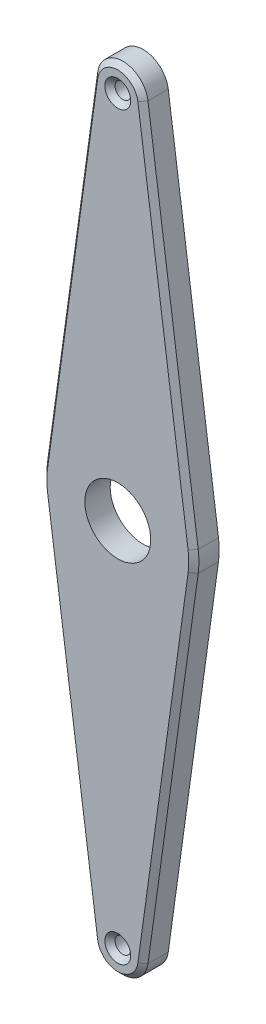
ISO-10303-21;
HEADER;
FILE_DESCRIPTION(('STEP AP214'),'2;1');
FILE_NAME('part.step','',(''),(''),'','','');
FILE_SCHEMA(('AUTOMOTIVE_DESIGN { 1 0 10303 214 1 1 1 1 }'));
ENDSEC;
DATA;
#1=APPLICATION_CONTEXT('core data for automotive mechanical design processes');
#2=APPLICATION_PROTOCOL_DEFINITION('international standard','automotive_design',2000,#1);
#3=PRODUCT_CONTEXT('',#1,'mechanical');
#4=PRODUCT('Part','Part','',(#3));
#5=PRODUCT_RELATED_PRODUCT_CATEGORY('part','',(#4));
#6=PRODUCT_DEFINITION_FORMATION('','',#4);
#7=PRODUCT_DEFINITION_CONTEXT('part definition',#1,'design');
#8=PRODUCT_DEFINITION('design','',#6,#7);
#9=PRODUCT_DEFINITION_SHAPE('','',#8);
#10=(LENGTH_UNIT() NAMED_UNIT(*) SI_UNIT(.MILLI.,.METRE.));
#11=(NAMED_UNIT(*) PLANE_ANGLE_UNIT() SI_UNIT($,.RADIAN.));
#12=(NAMED_UNIT(*) SI_UNIT($,.STERADIAN.) SOLID_ANGLE_UNIT());
#13=UNCERTAINTY_MEASURE_WITH_UNIT(LENGTH_MEASURE(1.E-05),#10,'distance_accuracy_value','');
#14=(GEOMETRIC_REPRESENTATION_CONTEXT(3) GLOBAL_UNCERTAINTY_ASSIGNED_CONTEXT((#13)) GLOBAL_UNIT_ASSIGNED_CONTEXT((#10,
#11,#12)) REPRESENTATION_CONTEXT('',''));
#15=CARTESIAN_POINT('',(0.,0.,0.));
#16=DIRECTION('',(0.,0.,1.));
#17=DIRECTION('',(1.,0.,0.));
#18=AXIS2_PLACEMENT_3D('',#15,#16,#17);
#19=CARTESIAN_POINT('',(0.,0.,5.00000000000002));
#20=DIRECTION('',(0.,0.,1.00000000000001));
#21=DIRECTION('',(1.,0.,0.));
#22=AXIS2_PLACEMENT_3D('',#19,#20,#21);
#23=PLANE('',#22);
#24=CARTESIAN_POINT('',(85.,68.,5.));
#25=DIRECTION('',(0.,0.,1.00000000000001));
#26=DIRECTION('',(1.,0.,0.));
#27=AXIS2_PLACEMENT_3D('',#24,#25,#26);
#28=CIRCLE('',#27,6.5);
#29=CARTESIAN_POINT('',(91.5,68.,5.));
#30=VERTEX_POINT('',#29);
#31=EDGE_CURVE('E343',#30,#30,#28,.F.);
#32=ORIENTED_EDGE('',*,*,#31,.T.);
#33=EDGE_LOOP('',(#32));
#34=FACE_BOUND('',#33,.T.);
#35=CARTESIAN_POINT('',(85.,-4.99999999999984,5.));
#36=DIRECTION('',(0.,0.,1.00000000000001));
#37=DIRECTION('',(1.,0.,0.));
#38=AXIS2_PLACEMENT_3D('',#35,#36,#37);
#39=CIRCLE('',#38,2.55000000000002);
#40=CARTESIAN_POINT('',(87.55,-4.99999999999984,5.));
#41=VERTEX_POINT('',#40);
#42=EDGE_CURVE('E42',#41,#41,#39,.F.);
#43=ORIENTED_EDGE('',*,*,#42,.T.);
#44=EDGE_LOOP('',(#43));
#45=FACE_BOUND('',#44,.T.);
#46=CARTESIAN_POINT('',(85.,68.,5.));
#47=DIRECTION('',(0.,0.,1.00000000000001));
#48=DIRECTION('',(1.,0.,0.));
#49=AXIS2_PLACEMENT_3D('',#46,#47,#48);
#50=CIRCLE('',#49,14.);
#51=CARTESIAN_POINT('',(71.1319788133111,69.9178082191781,5.00000000000002));
#52=VERTEX_POINT('',#51);
#53=CARTESIAN_POINT('',(71.1319788133111,66.0821917808219,5.00000000000002));
#54=VERTEX_POINT('',#53);
#55=EDGE_CURVE('E196',#52,#54,#50,.T.);
#56=ORIENTED_EDGE('',*,*,#55,.T.);
#57=DIRECTION('',(0.136986301369863,-0.990572941906352,0.));
#58=VECTOR('',#57,1.);
#59=CARTESIAN_POINT('',(78.764187639776,10.8922970623549,5.00000000000002));
#60=LINE('',#59,#58);
#61=CARTESIAN_POINT('',(81.0377082323746,-5.54794520547928,5.00000000000002));
#62=VERTEX_POINT('',#61);
#63=EDGE_CURVE('E198',#54,#62,#60,.T.);
#64=ORIENTED_EDGE('',*,*,#63,.T.);
#65=CARTESIAN_POINT('',(85.,-4.99999999999984,5.));
#66=DIRECTION('',(0.,0.,1.00000000000001));
#67=DIRECTION('',(1.,0.,0.));
#68=AXIS2_PLACEMENT_3D('',#65,#66,#67);
#69=CIRCLE('',#68,3.99999999999996);
#70=CARTESIAN_POINT('',(88.9622917676253,-5.54794520547928,5.00000000000002));
#71=VERTEX_POINT('',#70);
#72=EDGE_CURVE('E184',#62,#71,#69,.T.);
#73=ORIENTED_EDGE('',*,*,#72,.T.);
#74=DIRECTION('',(0.136986301369863,0.990572941906352,0.));
#75=VECTOR('',#74,1.);
#76=CARTESIAN_POINT('',(98.8680211866889,66.0821917808221,5.00000000000002));
#77=LINE('',#76,#75);
#78=CARTESIAN_POINT('',(98.8680211866889,66.0821917808221,5.00000000000002));
#79=VERTEX_POINT('',#78);
#80=EDGE_CURVE('E186',#71,#79,#77,.T.);
#81=ORIENTED_EDGE('',*,*,#80,.T.);
#82=CARTESIAN_POINT('',(85.,68.,5.));
#83=DIRECTION('',(0.,0.,1.00000000000001));
#84=DIRECTION('',(1.,0.,0.));
#85=AXIS2_PLACEMENT_3D('',#82,#83,#84);
#86=CIRCLE('',#85,14.);
#87=CARTESIAN_POINT('',(98.8680211866889,69.9178082191782,5.));
#88=VERTEX_POINT('',#87);
#89=EDGE_CURVE('E188',#79,#88,#86,.T.);
#90=ORIENTED_EDGE('',*,*,#89,.T.);
#91=DIRECTION('',(-0.136986301369863,0.990572941906352,0.));
#92=VECTOR('',#91,1.);
#93=CARTESIAN_POINT('',(106.500230013154,14.727913500711,5.00000000000002));
#94=LINE('',#93,#92);
#95=CARTESIAN_POINT('',(88.9622917676254,141.547945205479,5.));
#96=VERTEX_POINT('',#95);
#97=EDGE_CURVE('E190',#88,#96,#94,.T.);
#98=ORIENTED_EDGE('',*,*,#97,.T.);
#99=CARTESIAN_POINT('',(85.,141.,5.));
#100=DIRECTION('',(0.,0.,1.00000000000001));
#101=DIRECTION('',(1.,0.,0.));
#102=AXIS2_PLACEMENT_3D('',#99,#100,#101);
#103=CIRCLE('',#102,3.99999999999996);
#104=CARTESIAN_POINT('',(81.0377082323746,141.547945205479,5.00000000000002));
#105=VERTEX_POINT('',#104);
#106=EDGE_CURVE('E192',#96,#105,#103,.T.);
#107=ORIENTED_EDGE('',*,*,#106,.T.);
#108=DIRECTION('',(-0.136986301369863,-0.990572941906352,0.));
#109=VECTOR('',#108,1.);
#110=CARTESIAN_POINT('',(71.1319788133111,69.9178082191781,5.00000000000002));
#111=LINE('',#110,#109);
#112=EDGE_CURVE('E194',#105,#52,#111,.T.);
#113=ORIENTED_EDGE('',*,*,#112,.T.);
#114=EDGE_LOOP('',(#56,#64,#73,#81,#90,#98,#107,#113));
#115=FACE_BOUND('',#114,.T.);
#116=CARTESIAN_POINT('',(85.,141.,5.));
#117=DIRECTION('',(0.,0.,1.00000000000001));
#118=DIRECTION('',(1.,0.,0.));
#119=AXIS2_PLACEMENT_3D('',#116,#117,#118);
#120=CIRCLE('',#119,2.55000000000004);
#121=CARTESIAN_POINT('',(87.55,141.,5.));
#122=VERTEX_POINT('',#121);
#123=EDGE_CURVE('E234',#122,#122,#120,.F.);
#124=ORIENTED_EDGE('',*,*,#123,.T.);
#125=EDGE_LOOP('',(#124));
#126=FACE_BOUND('',#125,.T.);
#127=ADVANCED_FACE('F34',(#34,#45,#115,#126),#23,.T.);
#128=CARTESIAN_POINT('',(0.,0.,0.));
#129=DIRECTION('',(0.,0.,1.00000000000001));
#130=DIRECTION('',(1.,0.,0.));
#131=AXIS2_PLACEMENT_3D('',#128,#129,#130);
#132=PLANE('',#131);
#133=CARTESIAN_POINT('',(85.,68.,0.));
#134=DIRECTION('',(0.,0.,-1.00000000000001));
#135=DIRECTION('',(-1.,0.,0.));
#136=AXIS2_PLACEMENT_3D('',#133,#134,#135);
#137=CIRCLE('',#136,6.5);
#138=CARTESIAN_POINT('',(78.5,68.,0.));
#139=VERTEX_POINT('',#138);
#140=EDGE_CURVE('E339',#139,#139,#137,.T.);
#141=ORIENTED_EDGE('',*,*,#140,.F.);
#142=EDGE_LOOP('',(#141));
#143=FACE_BOUND('',#142,.T.);
#144=CARTESIAN_POINT('',(85.,-5.,0.));
#145=DIRECTION('',(0.,0.,1.00000000000001));
#146=DIRECTION('',(1.,0.,0.));
#147=AXIS2_PLACEMENT_3D('',#144,#145,#146);
#148=CIRCLE('',#147,4.99999999999999);
#149=CARTESIAN_POINT('',(89.9528647095317,-5.68493150684932,0.));
#150=VERTEX_POINT('',#149);
#151=CARTESIAN_POINT('',(80.0471352904682,-5.68493150684932,0.));
#152=VERTEX_POINT('',#151);
#153=EDGE_CURVE('E138',#150,#152,#148,.F.);
#154=ORIENTED_EDGE('',*,*,#153,.T.);
#155=DIRECTION('',(-0.136986301369863,0.990572941906352,0.));
#156=VECTOR('',#155,1.);
#157=CARTESIAN_POINT('',(77.7736146978696,10.755310760985,0.));
#158=LINE('',#157,#156);
#159=CARTESIAN_POINT('',(70.1414058714047,65.9452054794521,0.));
#160=VERTEX_POINT('',#159);
#161=EDGE_CURVE('E168',#152,#160,#158,.T.);
#162=ORIENTED_EDGE('',*,*,#161,.T.);
#163=CARTESIAN_POINT('',(85.,68.,0.));
#164=DIRECTION('',(0.,0.,1.00000000000001));
#165=DIRECTION('',(1.,0.,0.));
#166=AXIS2_PLACEMENT_3D('',#163,#164,#165);
#167=CIRCLE('',#166,15.);
#168=CARTESIAN_POINT('',(70.1414058714047,70.054794520548,0.));
#169=VERTEX_POINT('',#168);
#170=EDGE_CURVE('E165',#169,#160,#167,.T.);
#171=ORIENTED_EDGE('',*,*,#170,.F.);
#172=DIRECTION('',(-0.136986301369863,-0.990572941906352,0.));
#173=VECTOR('',#172,1.);
#174=CARTESIAN_POINT('',(59.3191050952307,-8.2032372012177,0.));
#175=LINE('',#174,#173);
#176=CARTESIAN_POINT('',(80.0471352904682,141.684931506849,0.));
#177=VERTEX_POINT('',#176);
#178=EDGE_CURVE('E162',#177,#169,#175,.T.);
#179=ORIENTED_EDGE('',*,*,#178,.F.);
#180=CARTESIAN_POINT('',(85.,141.,0.));
#181=DIRECTION('',(0.,0.,1.00000000000001));
#182=DIRECTION('',(1.,0.,0.));
#183=AXIS2_PLACEMENT_3D('',#180,#181,#182);
#184=CIRCLE('',#183,4.99999999999999);
#185=CARTESIAN_POINT('',(89.9528647095317,141.684931506849,0.));
#186=VERTEX_POINT('',#185);
#187=EDGE_CURVE('E159',#186,#177,#184,.T.);
#188=ORIENTED_EDGE('',*,*,#187,.F.);
#189=DIRECTION('',(0.136986301369863,-0.990572941906352,0.));
#190=VECTOR('',#189,1.);
#191=CARTESIAN_POINT('',(107.49080295506,14.8648998020809,0.));
#192=LINE('',#191,#190);
#193=CARTESIAN_POINT('',(99.8585941285953,70.0547945205481,0.));
#194=VERTEX_POINT('',#193);
#195=EDGE_CURVE('E157',#186,#194,#192,.T.);
#196=ORIENTED_EDGE('',*,*,#195,.T.);
#197=CARTESIAN_POINT('',(85.,68.,0.));
#198=DIRECTION('',(0.,0.,1.00000000000001));
#199=DIRECTION('',(1.,0.,0.));
#200=AXIS2_PLACEMENT_3D('',#197,#198,#199);
#201=CIRCLE('',#200,15.);
#202=CARTESIAN_POINT('',(99.8585941285952,65.9452054794522,0.));
#203=VERTEX_POINT('',#202);
#204=EDGE_CURVE('E142',#203,#194,#201,.T.);
#205=ORIENTED_EDGE('',*,*,#204,.F.);
#206=DIRECTION('',(0.136986301369863,0.990572941906352,0.));
#207=VECTOR('',#206,1.);
#208=CARTESIAN_POINT('',(89.0362933524212,-12.3128262423136,0.));
#209=LINE('',#208,#207);
#210=EDGE_CURVE('E125',#150,#203,#209,.T.);
#211=ORIENTED_EDGE('',*,*,#210,.F.);
#212=EDGE_LOOP('',(#154,#162,#171,#179,#188,#196,#205,#211));
#213=FACE_BOUND('',#212,.T.);
#214=CARTESIAN_POINT('',(85.,141.,0.));
#215=DIRECTION('',(0.,0.,1.00000000000001));
#216=DIRECTION('',(1.,0.,0.));
#217=AXIS2_PLACEMENT_3D('',#214,#215,#216);
#218=CIRCLE('',#217,1.55000000000001);
#219=CARTESIAN_POINT('',(86.55,141.,0.));
#220=VERTEX_POINT('',#219);
#221=EDGE_CURVE('E153',#220,#220,#218,.F.);
#222=ORIENTED_EDGE('',*,*,#221,.F.);
#223=EDGE_LOOP('',(#222));
#224=FACE_BOUND('',#223,.T.);
#225=CARTESIAN_POINT('',(85.,-5.,0.));
#226=DIRECTION('',(0.,0.,1.00000000000001));
#227=DIRECTION('',(1.,0.,0.));
#228=AXIS2_PLACEMENT_3D('',#225,#226,#227);
#229=CIRCLE('',#228,1.55000000000001);
#230=CARTESIAN_POINT('',(86.55,-5.,0.));
#231=VERTEX_POINT('',#230);
#232=EDGE_CURVE('E337',#231,#231,#229,.T.);
#233=ORIENTED_EDGE('',*,*,#232,.T.);
#234=EDGE_LOOP('',(#233));
#235=FACE_BOUND('',#234,.T.);
#236=ADVANCED_FACE('F135',(#143,#213,#224,#235),#132,.F.);
#237=CARTESIAN_POINT('',(85.,-4.99999999999984,5.));
#238=DIRECTION('',(0.,0.,-1.00000000000001));
#239=DIRECTION('',(-1.,0.,0.));
#240=AXIS2_PLACEMENT_3D('',#237,#238,#239);
#241=CYLINDRICAL_SURFACE('',#240,4.99999999999999);
#242=DIRECTION('',(0.,0.,-1.00000000000001));
#243=VECTOR('',#242,1.);
#244=CARTESIAN_POINT('',(89.9528647095317,-5.68493150684915,5.00000000000002));
#245=LINE('',#244,#243);
#246=CARTESIAN_POINT('',(89.9528647095317,-5.68493150684915,3.99999999999999));
#247=VERTEX_POINT('',#246);
#248=EDGE_CURVE('E122',#247,#150,#245,.T.);
#249=ORIENTED_EDGE('',*,*,#248,.F.);
#250=CARTESIAN_POINT('',(85.,-4.99999999999984,3.99999999999998));
#251=DIRECTION('',(0.,0.,1.00000000000001));
#252=DIRECTION('',(1.,0.,0.));
#253=AXIS2_PLACEMENT_3D('',#250,#251,#252);
#254=CIRCLE('',#253,4.99999999999999);
#255=CARTESIAN_POINT('',(80.0471352904682,-5.6849315068493,3.99999999999999));
#256=VERTEX_POINT('',#255);
#257=EDGE_CURVE('E211',#247,#256,#254,.F.);
#258=ORIENTED_EDGE('',*,*,#257,.T.);
#259=DIRECTION('',(0.,0.,-1.00000000000001));
#260=VECTOR('',#259,1.);
#261=CARTESIAN_POINT('',(80.0471352904682,-5.68493150684915,5.00000000000002));
#262=LINE('',#261,#260);
#263=EDGE_CURVE('E146',#256,#152,#262,.T.);
#264=ORIENTED_EDGE('',*,*,#263,.T.);
#265=ORIENTED_EDGE('',*,*,#153,.F.);
#266=EDGE_LOOP('',(#249,#258,#264,#265));
#267=FACE_BOUND('',#266,.T.);
#268=ADVANCED_FACE('F144',(#267),#241,.T.);
#269=CARTESIAN_POINT('',(89.0362933524212,-12.3128262423134,5.00000000000002));
#270=DIRECTION('',(-0.990572941906352,0.136986301369863,0.));
#271=DIRECTION('',(-0.136986301369863,-0.990572941906352,0.));
#272=AXIS2_PLACEMENT_3D('',#269,#270,#271);
#273=PLANE('',#272);
#274=DIRECTION('',(0.,0.,-1.00000000000001));
#275=VECTOR('',#274,1.);
#276=CARTESIAN_POINT('',(99.8585941285952,65.9452054794522,5.));
#277=LINE('',#276,#275);
#278=CARTESIAN_POINT('',(99.8585941285952,65.9452054794522,3.99999999999998));
#279=VERTEX_POINT('',#278);
#280=EDGE_CURVE('E131',#279,#203,#277,.T.);
#281=ORIENTED_EDGE('',*,*,#280,.F.);
#282=DIRECTION('',(-0.136986301369863,-0.990572941906352,0.));
#283=VECTOR('',#282,1.);
#284=CARTESIAN_POINT('',(89.9528647095317,-5.68493150684915,3.99999999999999));
#285=LINE('',#284,#283);
#286=EDGE_CURVE('E49',#279,#247,#285,.T.);
#287=ORIENTED_EDGE('',*,*,#286,.T.);
#288=ORIENTED_EDGE('',*,*,#248,.T.);
#289=ORIENTED_EDGE('',*,*,#210,.T.);
#290=EDGE_LOOP('',(#281,#287,#288,#289));
#291=FACE_BOUND('',#290,.T.);
#292=ADVANCED_FACE('F124',(#291),#273,.F.);
#293=CARTESIAN_POINT('',(85.,68.,5.));
#294=DIRECTION('',(0.,0.,-1.00000000000001));
#295=DIRECTION('',(-1.,0.,0.));
#296=AXIS2_PLACEMENT_3D('',#293,#294,#295);
#297=CYLINDRICAL_SURFACE('',#296,15.);
#298=DIRECTION('',(0.,0.,-1.00000000000001));
#299=VECTOR('',#298,1.);
#300=CARTESIAN_POINT('',(99.8585941285953,70.0547945205481,5.00000000000002));
#301=LINE('',#300,#299);
#302=CARTESIAN_POINT('',(99.8585941285953,70.0547945205481,3.99999999999999));
#303=VERTEX_POINT('',#302);
#304=EDGE_CURVE('E179',#303,#194,#301,.T.);
#305=ORIENTED_EDGE('',*,*,#304,.F.);
#306=CARTESIAN_POINT('',(85.,68.,3.99999999999998));
#307=DIRECTION('',(0.,0.,1.00000000000001));
#308=DIRECTION('',(1.,0.,0.));
#309=AXIS2_PLACEMENT_3D('',#306,#307,#308);
#310=CIRCLE('',#309,15.);
#311=EDGE_CURVE('E57',#303,#279,#310,.F.);
#312=ORIENTED_EDGE('',*,*,#311,.T.);
#313=ORIENTED_EDGE('',*,*,#280,.T.);
#314=ORIENTED_EDGE('',*,*,#204,.T.);
#315=EDGE_LOOP('',(#305,#312,#313,#314));
#316=FACE_BOUND('',#315,.T.);
#317=ADVANCED_FACE('F287',(#316),#297,.T.);
#318=CARTESIAN_POINT('',(107.49080295506,14.8648998020809,5.));
#319=DIRECTION('',(0.990572941906352,0.136986301369863,0.));
#320=DIRECTION('',(-0.136986301369863,0.990572941906352,0.));
#321=AXIS2_PLACEMENT_3D('',#318,#319,#320);
#322=PLANE('',#321);
#323=DIRECTION('',(0.,0.,-1.00000000000001));
#324=VECTOR('',#323,1.);
#325=CARTESIAN_POINT('',(89.9528647095317,141.684931506849,5.));
#326=LINE('',#325,#324);
#327=CARTESIAN_POINT('',(89.9528647095317,141.684931506849,3.99999999999997));
#328=VERTEX_POINT('',#327);
#329=EDGE_CURVE('E177',#328,#186,#326,.T.);
#330=ORIENTED_EDGE('',*,*,#329,.F.);
#331=DIRECTION('',(0.136986301369863,-0.990572941906352,0.));
#332=VECTOR('',#331,1.);
#333=CARTESIAN_POINT('',(107.49080295506,14.864899802081,3.99999999999997));
#334=LINE('',#333,#332);
#335=EDGE_CURVE('E207',#328,#303,#334,.T.);
#336=ORIENTED_EDGE('',*,*,#335,.T.);
#337=ORIENTED_EDGE('',*,*,#304,.T.);
#338=ORIENTED_EDGE('',*,*,#195,.F.);
#339=EDGE_LOOP('',(#330,#336,#337,#338));
#340=FACE_BOUND('',#339,.T.);
#341=ADVANCED_FACE('F283',(#340),#322,.T.);
#342=CARTESIAN_POINT('',(85.,141.,5.));
#343=DIRECTION('',(0.,0.,-1.00000000000001));
#344=DIRECTION('',(-1.,0.,0.));
#345=AXIS2_PLACEMENT_3D('',#342,#343,#344);
#346=CYLINDRICAL_SURFACE('',#345,4.99999999999999);
#347=DIRECTION('',(0.,0.,-1.00000000000001));
#348=VECTOR('',#347,1.);
#349=CARTESIAN_POINT('',(80.0471352904682,141.684931506849,5.));
#350=LINE('',#349,#348);
#351=CARTESIAN_POINT('',(80.0471352904682,141.684931506849,3.99999999999998));
#352=VERTEX_POINT('',#351);
#353=EDGE_CURVE('E175',#352,#177,#350,.T.);
#354=ORIENTED_EDGE('',*,*,#353,.F.);
#355=CARTESIAN_POINT('',(85.,141.,3.99999999999998));
#356=DIRECTION('',(0.,0.,1.00000000000001));
#357=DIRECTION('',(1.,0.,0.));
#358=AXIS2_PLACEMENT_3D('',#355,#356,#357);
#359=CIRCLE('',#358,4.99999999999999);
#360=EDGE_CURVE('E205',#352,#328,#359,.F.);
#361=ORIENTED_EDGE('',*,*,#360,.T.);
#362=ORIENTED_EDGE('',*,*,#329,.T.);
#363=ORIENTED_EDGE('',*,*,#187,.T.);
#364=EDGE_LOOP('',(#354,#361,#362,#363));
#365=FACE_BOUND('',#364,.T.);
#366=ADVANCED_FACE('F279',(#365),#346,.T.);
#367=CARTESIAN_POINT('',(59.3191050952307,-8.2032372012177,5.00000000000002));
#368=DIRECTION('',(0.990572941906352,-0.136986301369863,0.));
#369=DIRECTION('',(0.136986301369863,0.990572941906352,0.));
#370=AXIS2_PLACEMENT_3D('',#367,#368,#369);
#371=PLANE('',#370);
#372=DIRECTION('',(0.,0.,-1.00000000000001));
#373=VECTOR('',#372,1.);
#374=CARTESIAN_POINT('',(70.1414058714047,70.054794520548,5.00000000000002));
#375=LINE('',#374,#373);
#376=CARTESIAN_POINT('',(70.1414058714047,70.054794520548,3.99999999999999));
#377=VERTEX_POINT('',#376);
#378=EDGE_CURVE('E173',#377,#169,#375,.T.);
#379=ORIENTED_EDGE('',*,*,#378,.F.);
#380=DIRECTION('',(0.136986301369863,0.990572941906352,0.));
#381=VECTOR('',#380,1.);
#382=CARTESIAN_POINT('',(80.0471352904682,141.684931506849,3.99999999999998));
#383=LINE('',#382,#381);
#384=EDGE_CURVE('E203',#377,#352,#383,.T.);
#385=ORIENTED_EDGE('',*,*,#384,.T.);
#386=ORIENTED_EDGE('',*,*,#353,.T.);
#387=ORIENTED_EDGE('',*,*,#178,.T.);
#388=EDGE_LOOP('',(#379,#385,#386,#387));
#389=FACE_BOUND('',#388,.T.);
#390=ADVANCED_FACE('F275',(#389),#371,.F.);
#391=CARTESIAN_POINT('',(85.,68.,5.));
#392=DIRECTION('',(0.,0.,-1.00000000000001));
#393=DIRECTION('',(-1.,0.,0.));
#394=AXIS2_PLACEMENT_3D('',#391,#392,#393);
#395=CYLINDRICAL_SURFACE('',#394,15.);
#396=DIRECTION('',(0.,0.,-1.00000000000001));
#397=VECTOR('',#396,1.);
#398=CARTESIAN_POINT('',(70.1414058714047,65.9452054794521,5.));
#399=LINE('',#398,#397);
#400=CARTESIAN_POINT('',(70.1414058714047,65.9452054794521,3.99999999999997));
#401=VERTEX_POINT('',#400);
#402=EDGE_CURVE('E171',#401,#160,#399,.T.);
#403=ORIENTED_EDGE('',*,*,#402,.F.);
#404=CARTESIAN_POINT('',(85.,68.,3.99999999999998));
#405=DIRECTION('',(0.,0.,1.00000000000001));
#406=DIRECTION('',(1.,0.,0.));
#407=AXIS2_PLACEMENT_3D('',#404,#405,#406);
#408=CIRCLE('',#407,15.);
#409=EDGE_CURVE('E201',#401,#377,#408,.F.);
#410=ORIENTED_EDGE('',*,*,#409,.T.);
#411=ORIENTED_EDGE('',*,*,#378,.T.);
#412=ORIENTED_EDGE('',*,*,#170,.T.);
#413=EDGE_LOOP('',(#403,#410,#411,#412));
#414=FACE_BOUND('',#413,.T.);
#415=ADVANCED_FACE('F271',(#414),#395,.T.);
#416=CARTESIAN_POINT('',(77.7736146978696,10.755310760985,5.00000000000002));
#417=DIRECTION('',(-0.990572941906352,-0.136986301369863,0.));
#418=DIRECTION('',(0.136986301369863,-0.990572941906352,0.));
#419=AXIS2_PLACEMENT_3D('',#416,#417,#418);
#420=PLANE('',#419);
#421=ORIENTED_EDGE('',*,*,#263,.F.);
#422=DIRECTION('',(-0.136986301369863,0.990572941906352,0.));
#423=VECTOR('',#422,1.);
#424=CARTESIAN_POINT('',(77.7736146978696,10.7553107609851,3.99999999999999));
#425=LINE('',#424,#423);
#426=EDGE_CURVE('E130',#256,#401,#425,.T.);
#427=ORIENTED_EDGE('',*,*,#426,.T.);
#428=ORIENTED_EDGE('',*,*,#402,.T.);
#429=ORIENTED_EDGE('',*,*,#161,.F.);
#430=EDGE_LOOP('',(#421,#427,#428,#429));
#431=FACE_BOUND('',#430,.T.);
#432=ADVANCED_FACE('F267',(#431),#420,.T.);
#433=CARTESIAN_POINT('',(107.49080295506,14.864899802081,3.99999999999998));
#434=DIRECTION('',(-0.700440844481893,-0.0968639426282947,-0.707106781186546));
#435=DIRECTION('',(0.136986301369863,-0.990572941906352,0.));
#436=AXIS2_PLACEMENT_3D('',#433,#434,#435);
#437=PLANE('',#436);
#438=DIRECTION('',(0.700440844481886,0.0968639426283034,-0.707106781186554));
#439=VECTOR('',#438,1.);
#440=CARTESIAN_POINT('',(88.9622917676254,141.547945205479,5.));
#441=LINE('',#440,#439);
#442=EDGE_CURVE('E150',#96,#328,#441,.T.);
#443=ORIENTED_EDGE('',*,*,#442,.F.);
#444=ORIENTED_EDGE('',*,*,#97,.F.);
#445=DIRECTION('',(-0.700440844481887,-0.0968639426282937,0.707106781186554));
#446=VECTOR('',#445,1.);
#447=CARTESIAN_POINT('',(99.8585941285953,70.0547945205481,3.99999999999999));
#448=LINE('',#447,#446);
#449=EDGE_CURVE('E147',#303,#88,#448,.T.);
#450=ORIENTED_EDGE('',*,*,#449,.F.);
#451=ORIENTED_EDGE('',*,*,#335,.F.);
#452=EDGE_LOOP('',(#443,#444,#450,#451));
#453=FACE_BOUND('',#452,.T.);
#454=ADVANCED_FACE('F270',(#453),#437,.F.);
#455=CARTESIAN_POINT('',(85.,68.,5.));
#456=DIRECTION('',(0.,0.,-1.00000000000001));
#457=DIRECTION('',(-1.,0.,0.));
#458=AXIS2_PLACEMENT_3D('',#455,#456,#457);
#459=CONICAL_SURFACE('',#458,14.,0.785398163397446);
#460=ORIENTED_EDGE('',*,*,#449,.T.);
#461=ORIENTED_EDGE('',*,*,#89,.F.);
#462=DIRECTION('',(-0.700440844481886,0.0968639426282937,0.707106781186555));
#463=VECTOR('',#462,1.);
#464=CARTESIAN_POINT('',(99.8585941285953,65.9452054794522,3.99999999999998));
#465=LINE('',#464,#463);
#466=EDGE_CURVE('E227',#279,#79,#465,.T.);
#467=ORIENTED_EDGE('',*,*,#466,.F.);
#468=ORIENTED_EDGE('',*,*,#311,.F.);
#469=EDGE_LOOP('',(#460,#461,#467,#468));
#470=FACE_BOUND('',#469,.T.);
#471=ADVANCED_FACE('F318',(#470),#459,.T.);
#472=CARTESIAN_POINT('',(85.,141.,5.));
#473=DIRECTION('',(0.,0.,-1.00000000000001));
#474=DIRECTION('',(-1.,0.,0.));
#475=AXIS2_PLACEMENT_3D('',#472,#473,#474);
#476=CONICAL_SURFACE('',#475,3.99999999999996,0.78539816339745);
#477=ORIENTED_EDGE('',*,*,#442,.T.);
#478=ORIENTED_EDGE('',*,*,#360,.F.);
#479=DIRECTION('',(-0.700440844481889,0.0968639426283028,-0.707106781186547));
#480=VECTOR('',#479,1.);
#481=CARTESIAN_POINT('',(81.0377082323746,141.547945205479,5.00000000000002));
#482=LINE('',#481,#480);
#483=EDGE_CURVE('E224',#105,#352,#482,.T.);
#484=ORIENTED_EDGE('',*,*,#483,.F.);
#485=ORIENTED_EDGE('',*,*,#106,.F.);
#486=EDGE_LOOP('',(#477,#478,#484,#485));
#487=FACE_BOUND('',#486,.T.);
#488=ADVANCED_FACE('F314',(#487),#476,.T.);
#489=CARTESIAN_POINT('',(88.0457204105148,-12.1758399409436,5.));
#490=DIRECTION('',(0.700440844481887,-0.096863942628294,0.70710678118655));
#491=DIRECTION('',(-0.136986301369863,-0.990572941906352,0.));
#492=AXIS2_PLACEMENT_3D('',#489,#490,#491);
#493=PLANE('',#492);
#494=ORIENTED_EDGE('',*,*,#466,.T.);
#495=ORIENTED_EDGE('',*,*,#80,.F.);
#496=DIRECTION('',(-0.700440844481891,0.0968639426282949,0.70710678118655));
#497=VECTOR('',#496,1.);
#498=CARTESIAN_POINT('',(89.9528647095317,-5.68493150684915,3.99999999999999));
#499=LINE('',#498,#497);
#500=EDGE_CURVE('E221',#247,#71,#499,.T.);
#501=ORIENTED_EDGE('',*,*,#500,.F.);
#502=ORIENTED_EDGE('',*,*,#286,.F.);
#503=EDGE_LOOP('',(#494,#495,#501,#502));
#504=FACE_BOUND('',#503,.T.);
#505=ADVANCED_FACE('F310',(#504),#493,.T.);
#506=CARTESIAN_POINT('',(60.3096780371371,-8.34022350258756,5.00000000000002));
#507=DIRECTION('',(-0.700440844481888,0.096863942628294,0.707106781186553));
#508=DIRECTION('',(0.136986301369863,0.990572941906352,0.));
#509=AXIS2_PLACEMENT_3D('',#506,#507,#508);
#510=PLANE('',#509);
#511=ORIENTED_EDGE('',*,*,#483,.T.);
#512=ORIENTED_EDGE('',*,*,#384,.F.);
#513=DIRECTION('',(-0.70044084448189,0.0968639426282931,-0.707106781186548));
#514=VECTOR('',#513,1.);
#515=CARTESIAN_POINT('',(71.1319788133111,69.9178082191781,5.00000000000002));
#516=LINE('',#515,#514);
#517=EDGE_CURVE('E218',#52,#377,#516,.T.);
#518=ORIENTED_EDGE('',*,*,#517,.F.);
#519=ORIENTED_EDGE('',*,*,#112,.F.);
#520=EDGE_LOOP('',(#511,#512,#518,#519));
#521=FACE_BOUND('',#520,.T.);
#522=ADVANCED_FACE('F306',(#521),#510,.T.);
#523=CARTESIAN_POINT('',(85.,-4.99999999999984,3.99999999999998));
#524=DIRECTION('',(0.,0.,-1.00000000000001));
#525=DIRECTION('',(-1.,0.,0.));
#526=AXIS2_PLACEMENT_3D('',#523,#524,#525);
#527=CONICAL_SURFACE('',#526,4.99999999999999,0.785398163397449);
#528=ORIENTED_EDGE('',*,*,#500,.T.);
#529=ORIENTED_EDGE('',*,*,#72,.F.);
#530=DIRECTION('',(0.700440844481891,0.0968639426282943,0.707106781186549));
#531=VECTOR('',#530,1.);
#532=CARTESIAN_POINT('',(80.0471352904682,-5.6849315068493,3.99999999999999));
#533=LINE('',#532,#531);
#534=EDGE_CURVE('E216',#256,#62,#533,.T.);
#535=ORIENTED_EDGE('',*,*,#534,.F.);
#536=ORIENTED_EDGE('',*,*,#257,.F.);
#537=EDGE_LOOP('',(#528,#529,#535,#536));
#538=FACE_BOUND('',#537,.T.);
#539=ADVANCED_FACE('F302',(#538),#527,.T.);
#540=CARTESIAN_POINT('',(85.,68.,5.));
#541=DIRECTION('',(0.,0.,-1.00000000000001));
#542=DIRECTION('',(-1.,0.,0.));
#543=AXIS2_PLACEMENT_3D('',#540,#541,#542);
#544=CONICAL_SURFACE('',#543,14.,0.78539816339745);
#545=ORIENTED_EDGE('',*,*,#517,.T.);
#546=ORIENTED_EDGE('',*,*,#409,.F.);
#547=DIRECTION('',(-0.700440844481891,-0.0968639426282931,-0.707106781186549));
#548=VECTOR('',#547,1.);
#549=CARTESIAN_POINT('',(71.1319788133111,66.0821917808219,5.00000000000002));
#550=LINE('',#549,#548);
#551=EDGE_CURVE('E214',#54,#401,#550,.T.);
#552=ORIENTED_EDGE('',*,*,#551,.F.);
#553=ORIENTED_EDGE('',*,*,#55,.F.);
#554=EDGE_LOOP('',(#545,#546,#552,#553));
#555=FACE_BOUND('',#554,.T.);
#556=ADVANCED_FACE('F298',(#555),#544,.T.);
#557=CARTESIAN_POINT('',(77.7736146978696,10.7553107609851,3.99999999999999));
#558=DIRECTION('',(0.700440844481885,0.0968639426282933,-0.707106781186556));
#559=DIRECTION('',(-0.136986301369863,0.990572941906352,0.));
#560=AXIS2_PLACEMENT_3D('',#557,#558,#559);
#561=PLANE('',#560);
#562=ORIENTED_EDGE('',*,*,#534,.T.);
#563=ORIENTED_EDGE('',*,*,#63,.F.);
#564=ORIENTED_EDGE('',*,*,#551,.T.);
#565=ORIENTED_EDGE('',*,*,#426,.F.);
#566=EDGE_LOOP('',(#562,#563,#564,#565));
#567=FACE_BOUND('',#566,.T.);
#568=ADVANCED_FACE('F295',(#567),#561,.F.);
#569=CARTESIAN_POINT('',(85.,141.,-0.00100000000000794));
#570=DIRECTION('',(0.,0.,1.00000000000001));
#571=DIRECTION('',(1.,0.,0.));
#572=AXIS2_PLACEMENT_3D('',#569,#570,#571);
#573=CYLINDRICAL_SURFACE('',#572,1.55000000000001);
#574=CARTESIAN_POINT('',(85.,141.,3.99999999999998));
#575=DIRECTION('',(0.,0.,1.00000000000001));
#576=DIRECTION('',(1.,0.,0.));
#577=AXIS2_PLACEMENT_3D('',#574,#575,#576);
#578=CIRCLE('',#577,1.55000000000001);
#579=CARTESIAN_POINT('',(86.55,141.,3.99999999999998));
#580=VERTEX_POINT('',#579);
#581=EDGE_CURVE('E213',#580,#580,#578,.T.);
#582=ORIENTED_EDGE('',*,*,#581,.T.);
#583=EDGE_LOOP('',(#582));
#584=FACE_BOUND('',#583,.T.);
#585=ORIENTED_EDGE('',*,*,#221,.T.);
#586=EDGE_LOOP('',(#585));
#587=FACE_BOUND('',#586,.T.);
#588=ADVANCED_FACE('F265',(#584,#587),#573,.F.);
#589=CARTESIAN_POINT('',(85.,141.,3.99999999999998));
#590=DIRECTION('',(0.,0.,1.00000000000001));
#591=DIRECTION('',(1.,0.,0.));
#592=AXIS2_PLACEMENT_3D('',#589,#590,#591);
#593=CONICAL_SURFACE('',#592,1.55000000000001,0.785398163397452);
#594=ORIENTED_EDGE('',*,*,#123,.F.);
#595=EDGE_LOOP('',(#594));
#596=FACE_BOUND('',#595,.T.);
#597=ORIENTED_EDGE('',*,*,#581,.F.);
#598=EDGE_LOOP('',(#597));
#599=FACE_BOUND('',#598,.T.);
#600=ADVANCED_FACE('F251',(#596,#599),#593,.F.);
#601=CARTESIAN_POINT('',(85.,-5.,-0.00100000000000794));
#602=DIRECTION('',(0.,0.,1.00000000000001));
#603=DIRECTION('',(1.,0.,0.));
#604=AXIS2_PLACEMENT_3D('',#601,#602,#603);
#605=CYLINDRICAL_SURFACE('',#604,1.55000000000001);
#606=CARTESIAN_POINT('',(85.,-4.99999999999984,3.99999999999999));
#607=DIRECTION('',(0.,0.,1.00000000000001));
#608=DIRECTION('',(1.,0.,0.));
#609=AXIS2_PLACEMENT_3D('',#606,#607,#608);
#610=CIRCLE('',#609,1.55000000000001);
#611=CARTESIAN_POINT('',(86.55,-4.99999999999984,3.99999999999999));
#612=VERTEX_POINT('',#611);
#613=EDGE_CURVE('E11',#612,#612,#610,.T.);
#614=ORIENTED_EDGE('',*,*,#613,.T.);
#615=EDGE_LOOP('',(#614));
#616=FACE_BOUND('',#615,.T.);
#617=ORIENTED_EDGE('',*,*,#232,.F.);
#618=EDGE_LOOP('',(#617));
#619=FACE_BOUND('',#618,.T.);
#620=ADVANCED_FACE('F243',(#616,#619),#605,.F.);
#621=CARTESIAN_POINT('',(85.,-4.99999999999984,5.));
#622=DIRECTION('',(0.,0.,1.00000000000001));
#623=DIRECTION('',(1.,0.,0.));
#624=AXIS2_PLACEMENT_3D('',#621,#622,#623);
#625=CONICAL_SURFACE('',#624,2.55000000000002,0.785398163397454);
#626=ORIENTED_EDGE('',*,*,#613,.F.);
#627=EDGE_LOOP('',(#626));
#628=FACE_BOUND('',#627,.T.);
#629=ORIENTED_EDGE('',*,*,#42,.F.);
#630=EDGE_LOOP('',(#629));
#631=FACE_BOUND('',#630,.T.);
#632=ADVANCED_FACE('F36',(#628,#631),#625,.F.);
#633=CARTESIAN_POINT('',(85.,68.,5.001));
#634=DIRECTION('',(0.,0.,-1.00000000000001));
#635=DIRECTION('',(-1.,0.,0.));
#636=AXIS2_PLACEMENT_3D('',#633,#634,#635);
#637=CYLINDRICAL_SURFACE('',#636,6.5);
#638=ORIENTED_EDGE('',*,*,#31,.F.);
#639=EDGE_LOOP('',(#638));
#640=FACE_BOUND('',#639,.T.);
#641=ORIENTED_EDGE('',*,*,#140,.T.);
#642=EDGE_LOOP('',(#641));
#643=FACE_BOUND('',#642,.T.);
#644=ADVANCED_FACE('F242',(#640,#643),#637,.F.);
#645=CLOSED_SHELL('',(#127,#236,#268,#292,#317,#341,#366,#390,#415,#432,#454,#471,#488,#505,
#522,#539,#556,#568,#588,#600,#620,#632,#644));
#646=MANIFOLD_SOLID_BREP('B2',#645);
#647=ADVANCED_BREP_SHAPE_REPRESENTATION('',(#18,#646),#14);
#648=SHAPE_DEFINITION_REPRESENTATION(#9,#647);
ENDSEC;
END-ISO-10303-21;
